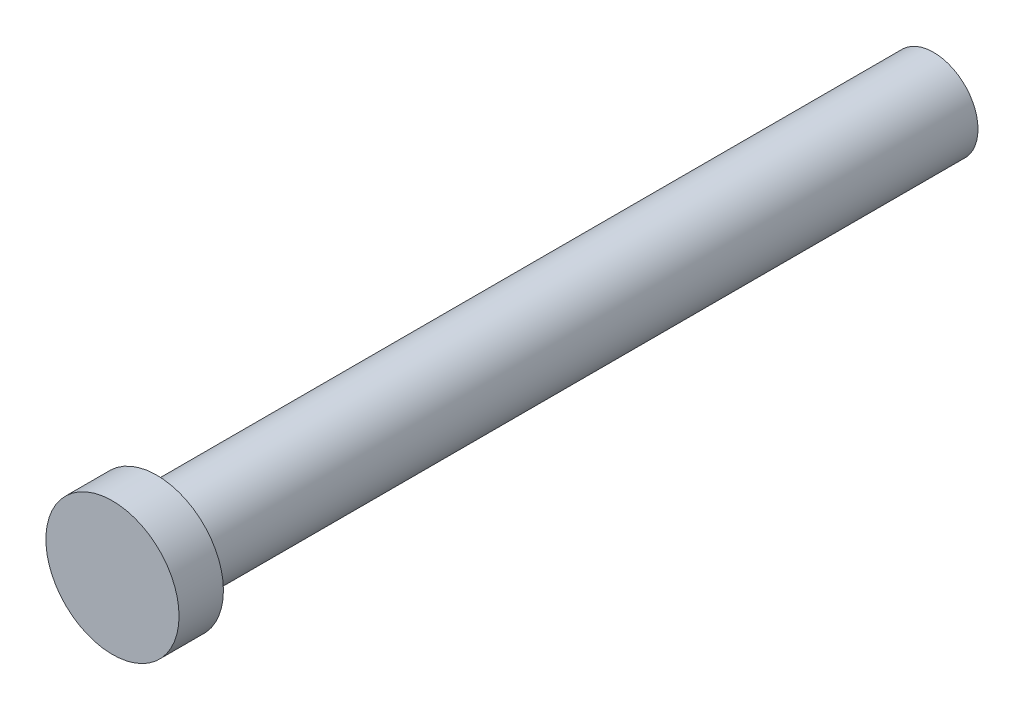
ISO-10303-21;
HEADER;
FILE_DESCRIPTION(('STEP AP214'),'2;1');
FILE_NAME('part.step','',(''),(''),'','','');
FILE_SCHEMA(('AUTOMOTIVE_DESIGN { 1 0 10303 214 1 1 1 1 }'));
ENDSEC;
DATA;
#1=APPLICATION_CONTEXT('core data for automotive mechanical design processes');
#2=APPLICATION_PROTOCOL_DEFINITION('international standard','automotive_design',2000,#1);
#3=PRODUCT_CONTEXT('',#1,'mechanical');
#4=PRODUCT('Part','Part','',(#3));
#5=PRODUCT_RELATED_PRODUCT_CATEGORY('part','',(#4));
#6=PRODUCT_DEFINITION_FORMATION('','',#4);
#7=PRODUCT_DEFINITION_CONTEXT('part definition',#1,'design');
#8=PRODUCT_DEFINITION('design','',#6,#7);
#9=PRODUCT_DEFINITION_SHAPE('','',#8);
#10=(LENGTH_UNIT() NAMED_UNIT(*) SI_UNIT(.MILLI.,.METRE.));
#11=(NAMED_UNIT(*) PLANE_ANGLE_UNIT() SI_UNIT($,.RADIAN.));
#12=(NAMED_UNIT(*) SI_UNIT($,.STERADIAN.) SOLID_ANGLE_UNIT());
#13=UNCERTAINTY_MEASURE_WITH_UNIT(LENGTH_MEASURE(1.E-05),#10,'distance_accuracy_value','');
#14=(GEOMETRIC_REPRESENTATION_CONTEXT(3) GLOBAL_UNCERTAINTY_ASSIGNED_CONTEXT((#13)) GLOBAL_UNIT_ASSIGNED_CONTEXT((#10,
#11,#12)) REPRESENTATION_CONTEXT('',''));
#15=CARTESIAN_POINT('',(0.,0.,0.));
#16=DIRECTION('',(0.,0.,1.));
#17=DIRECTION('',(1.,0.,0.));
#18=AXIS2_PLACEMENT_3D('',#15,#16,#17);
#19=CARTESIAN_POINT('',(0.,0.,35.));
#20=DIRECTION('',(0.,0.,-1.));
#21=DIRECTION('',(-1.,0.,0.));
#22=AXIS2_PLACEMENT_3D('',#19,#20,#21);
#23=CYLINDRICAL_SURFACE('',#22,2.);
#24=CARTESIAN_POINT('',(0.,0.,35.));
#25=DIRECTION('',(0.,0.,1.));
#26=DIRECTION('',(1.,0.,0.));
#27=AXIS2_PLACEMENT_3D('',#24,#25,#26);
#28=CIRCLE('',#27,2.);
#29=CARTESIAN_POINT('',(2.,0.,35.));
#30=VERTEX_POINT('',#29);
#31=EDGE_CURVE('E10',#30,#30,#28,.T.);
#32=ORIENTED_EDGE('',*,*,#31,.F.);
#33=EDGE_LOOP('',(#32));
#34=FACE_BOUND('',#33,.T.);
#35=CARTESIAN_POINT('',(0.,0.,0.));
#36=DIRECTION('',(0.,0.,1.));
#37=DIRECTION('',(1.,0.,0.));
#38=AXIS2_PLACEMENT_3D('',#35,#36,#37);
#39=CIRCLE('',#38,2.);
#40=CARTESIAN_POINT('',(2.,0.,0.));
#41=VERTEX_POINT('',#40);
#42=EDGE_CURVE('E41',#41,#41,#39,.T.);
#43=ORIENTED_EDGE('',*,*,#42,.T.);
#44=EDGE_LOOP('',(#43));
#45=FACE_BOUND('',#44,.T.);
#46=ADVANCED_FACE('F38',(#34,#45),#23,.T.);
#47=CARTESIAN_POINT('',(0.,0.,0.));
#48=DIRECTION('',(0.,0.,1.));
#49=DIRECTION('',(1.,0.,0.));
#50=AXIS2_PLACEMENT_3D('',#47,#48,#49);
#51=PLANE('',#50);
#52=ORIENTED_EDGE('',*,*,#42,.F.);
#53=EDGE_LOOP('',(#52));
#54=FACE_BOUND('',#53,.T.);
#55=ADVANCED_FACE('F65',(#54),#51,.F.);
#56=CARTESIAN_POINT('',(0.,0.,37.));
#57=DIRECTION('',(0.,0.,-1.));
#58=DIRECTION('',(-1.,0.,0.));
#59=AXIS2_PLACEMENT_3D('',#56,#57,#58);
#60=CYLINDRICAL_SURFACE('',#59,3.);
#61=CARTESIAN_POINT('',(0.,0.,37.));
#62=DIRECTION('',(0.,0.,1.));
#63=DIRECTION('',(1.,0.,0.));
#64=AXIS2_PLACEMENT_3D('',#61,#62,#63);
#65=CIRCLE('',#64,3.);
#66=CARTESIAN_POINT('',(3.,0.,37.));
#67=VERTEX_POINT('',#66);
#68=EDGE_CURVE('E50',#67,#67,#65,.T.);
#69=ORIENTED_EDGE('',*,*,#68,.F.);
#70=EDGE_LOOP('',(#69));
#71=FACE_BOUND('',#70,.T.);
#72=CARTESIAN_POINT('',(0.,0.,35.));
#73=DIRECTION('',(0.,0.,1.));
#74=DIRECTION('',(1.,0.,0.));
#75=AXIS2_PLACEMENT_3D('',#72,#73,#74);
#76=CIRCLE('',#75,3.);
#77=CARTESIAN_POINT('',(3.,0.,35.));
#78=VERTEX_POINT('',#77);
#79=EDGE_CURVE('E52',#78,#78,#76,.T.);
#80=ORIENTED_EDGE('',*,*,#79,.T.);
#81=EDGE_LOOP('',(#80));
#82=FACE_BOUND('',#81,.T.);
#83=ADVANCED_FACE('F62',(#71,#82),#60,.T.);
#84=CARTESIAN_POINT('',(0.,0.,37.));
#85=DIRECTION('',(0.,0.,1.));
#86=DIRECTION('',(1.,0.,0.));
#87=AXIS2_PLACEMENT_3D('',#84,#85,#86);
#88=PLANE('',#87);
#89=ORIENTED_EDGE('',*,*,#68,.T.);
#90=EDGE_LOOP('',(#89));
#91=FACE_BOUND('',#90,.T.);
#92=ADVANCED_FACE('F60',(#91),#88,.T.);
#93=CARTESIAN_POINT('',(0.,0.,35.));
#94=DIRECTION('',(0.,0.,1.));
#95=DIRECTION('',(1.,0.,0.));
#96=AXIS2_PLACEMENT_3D('',#93,#94,#95);
#97=PLANE('',#96);
#98=ORIENTED_EDGE('',*,*,#31,.T.);
#99=EDGE_LOOP('',(#98));
#100=FACE_BOUND('',#99,.T.);
#101=ORIENTED_EDGE('',*,*,#79,.F.);
#102=EDGE_LOOP('',(#101));
#103=FACE_BOUND('',#102,.T.);
#104=ADVANCED_FACE('F69',(#100,#103),#97,.F.);
#105=CLOSED_SHELL('',(#46,#55,#83,#92,#104));
#106=MANIFOLD_SOLID_BREP('B2',#105);
#107=ADVANCED_BREP_SHAPE_REPRESENTATION('',(#18,#106),#14);
#108=SHAPE_DEFINITION_REPRESENTATION(#9,#107);
ENDSEC;
END-ISO-10303-21;
